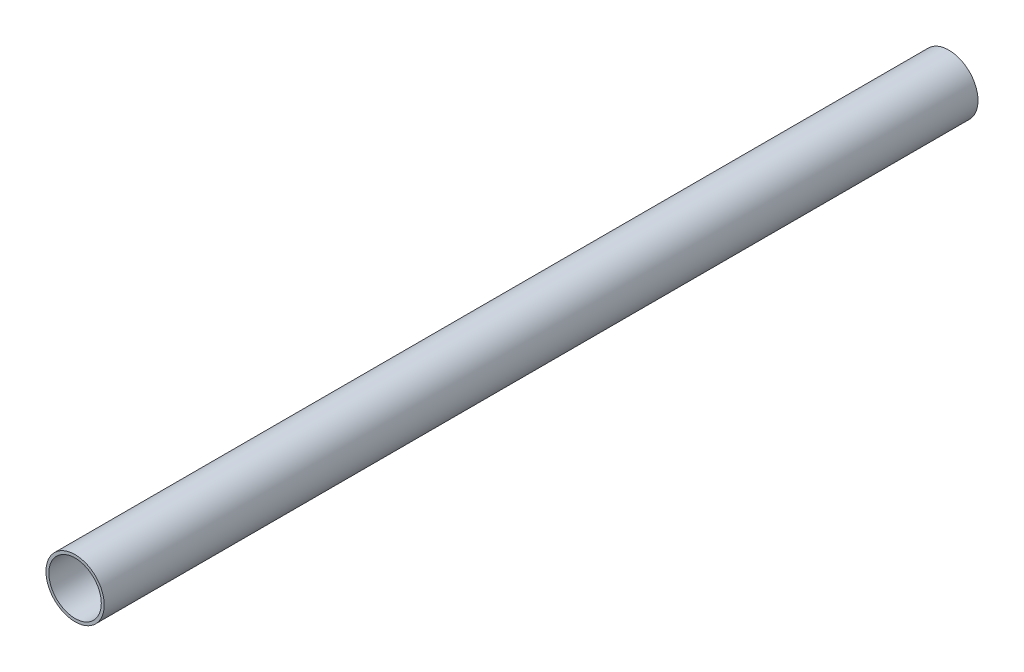
ISO-10303-21;
HEADER;
FILE_DESCRIPTION(('STEP AP214'),'2;1');
FILE_NAME('part.step','',(''),(''),'','','');
FILE_SCHEMA(('AUTOMOTIVE_DESIGN { 1 0 10303 214 1 1 1 1 }'));
ENDSEC;
DATA;
#1=APPLICATION_CONTEXT('core data for automotive mechanical design processes');
#2=APPLICATION_PROTOCOL_DEFINITION('international standard','automotive_design',2000,#1);
#3=PRODUCT_CONTEXT('',#1,'mechanical');
#4=PRODUCT('Part','Part','',(#3));
#5=PRODUCT_RELATED_PRODUCT_CATEGORY('part','',(#4));
#6=PRODUCT_DEFINITION_FORMATION('','',#4);
#7=PRODUCT_DEFINITION_CONTEXT('part definition',#1,'design');
#8=PRODUCT_DEFINITION('design','',#6,#7);
#9=PRODUCT_DEFINITION_SHAPE('','',#8);
#10=(LENGTH_UNIT() NAMED_UNIT(*) SI_UNIT(.MILLI.,.METRE.));
#11=(NAMED_UNIT(*) PLANE_ANGLE_UNIT() SI_UNIT($,.RADIAN.));
#12=(NAMED_UNIT(*) SI_UNIT($,.STERADIAN.) SOLID_ANGLE_UNIT());
#13=UNCERTAINTY_MEASURE_WITH_UNIT(LENGTH_MEASURE(1.E-05),#10,'distance_accuracy_value','');
#14=(GEOMETRIC_REPRESENTATION_CONTEXT(3) GLOBAL_UNCERTAINTY_ASSIGNED_CONTEXT((#13)) GLOBAL_UNIT_ASSIGNED_CONTEXT((#10,
#11,#12)) REPRESENTATION_CONTEXT('',''));
#15=CARTESIAN_POINT('',(0.,0.,0.));
#16=DIRECTION('',(0.,0.,1.));
#17=DIRECTION('',(1.,0.,0.));
#18=AXIS2_PLACEMENT_3D('',#15,#16,#17);
#19=CARTESIAN_POINT('',(0.,0.,150.));
#20=DIRECTION('',(0.,0.,1.));
#21=DIRECTION('',(1.,0.,0.));
#22=AXIS2_PLACEMENT_3D('',#19,#20,#21);
#23=PLANE('',#22);
#24=CARTESIAN_POINT('',(0.,0.,150.));
#25=DIRECTION('',(0.,0.,1.));
#26=DIRECTION('',(1.,0.,0.));
#27=AXIS2_PLACEMENT_3D('',#24,#25,#26);
#28=CIRCLE('',#27,5.);
#29=CARTESIAN_POINT('',(5.,0.,150.));
#30=VERTEX_POINT('',#29);
#31=EDGE_CURVE('E10',#30,#30,#28,.T.);
#32=ORIENTED_EDGE('',*,*,#31,.T.);
#33=EDGE_LOOP('',(#32));
#34=FACE_BOUND('',#33,.T.);
#35=CARTESIAN_POINT('',(0.,0.,150.));
#36=DIRECTION('',(0.,0.,1.));
#37=DIRECTION('',(1.,0.,0.));
#38=AXIS2_PLACEMENT_3D('',#35,#36,#37);
#39=CIRCLE('',#38,4.5);
#40=CARTESIAN_POINT('',(4.5,0.,150.));
#41=VERTEX_POINT('',#40);
#42=EDGE_CURVE('E46',#41,#41,#39,.T.);
#43=ORIENTED_EDGE('',*,*,#42,.F.);
#44=EDGE_LOOP('',(#43));
#45=FACE_BOUND('',#44,.T.);
#46=ADVANCED_FACE('F35',(#34,#45),#23,.T.);
#47=CARTESIAN_POINT('',(0.,0.,0.));
#48=DIRECTION('',(0.,0.,1.));
#49=DIRECTION('',(1.,0.,0.));
#50=AXIS2_PLACEMENT_3D('',#47,#48,#49);
#51=PLANE('',#50);
#52=CARTESIAN_POINT('',(0.,0.,0.));
#53=DIRECTION('',(0.,0.,1.));
#54=DIRECTION('',(1.,0.,0.));
#55=AXIS2_PLACEMENT_3D('',#52,#53,#54);
#56=CIRCLE('',#55,5.);
#57=CARTESIAN_POINT('',(5.,0.,0.));
#58=VERTEX_POINT('',#57);
#59=EDGE_CURVE('E39',#58,#58,#56,.T.);
#60=ORIENTED_EDGE('',*,*,#59,.F.);
#61=EDGE_LOOP('',(#60));
#62=FACE_BOUND('',#61,.T.);
#63=CARTESIAN_POINT('',(0.,0.,0.));
#64=DIRECTION('',(0.,0.,1.));
#65=DIRECTION('',(1.,0.,0.));
#66=AXIS2_PLACEMENT_3D('',#63,#64,#65);
#67=CIRCLE('',#66,4.5);
#68=CARTESIAN_POINT('',(4.5,0.,0.));
#69=VERTEX_POINT('',#68);
#70=EDGE_CURVE('E48',#69,#69,#67,.T.);
#71=ORIENTED_EDGE('',*,*,#70,.T.);
#72=EDGE_LOOP('',(#71));
#73=FACE_BOUND('',#72,.T.);
#74=ADVANCED_FACE('F58',(#62,#73),#51,.F.);
#75=CARTESIAN_POINT('',(0.,0.,150.));
#76=DIRECTION('',(0.,0.,-1.));
#77=DIRECTION('',(-1.,0.,0.));
#78=AXIS2_PLACEMENT_3D('',#75,#76,#77);
#79=CYLINDRICAL_SURFACE('',#78,5.);
#80=ORIENTED_EDGE('',*,*,#31,.F.);
#81=EDGE_LOOP('',(#80));
#82=FACE_BOUND('',#81,.T.);
#83=ORIENTED_EDGE('',*,*,#59,.T.);
#84=EDGE_LOOP('',(#83));
#85=FACE_BOUND('',#84,.T.);
#86=ADVANCED_FACE('F37',(#82,#85),#79,.T.);
#87=CARTESIAN_POINT('',(0.,0.,150.));
#88=DIRECTION('',(0.,0.,-1.));
#89=DIRECTION('',(-1.,0.,0.));
#90=AXIS2_PLACEMENT_3D('',#87,#88,#89);
#91=CYLINDRICAL_SURFACE('',#90,4.5);
#92=ORIENTED_EDGE('',*,*,#42,.T.);
#93=EDGE_LOOP('',(#92));
#94=FACE_BOUND('',#93,.T.);
#95=ORIENTED_EDGE('',*,*,#70,.F.);
#96=EDGE_LOOP('',(#95));
#97=FACE_BOUND('',#96,.T.);
#98=ADVANCED_FACE('F54',(#94,#97),#91,.F.);
#99=CLOSED_SHELL('',(#46,#74,#86,#98));
#100=MANIFOLD_SOLID_BREP('B2',#99);
#101=ADVANCED_BREP_SHAPE_REPRESENTATION('',(#18,#100),#14);
#102=SHAPE_DEFINITION_REPRESENTATION(#9,#101);
ENDSEC;
END-ISO-10303-21;
